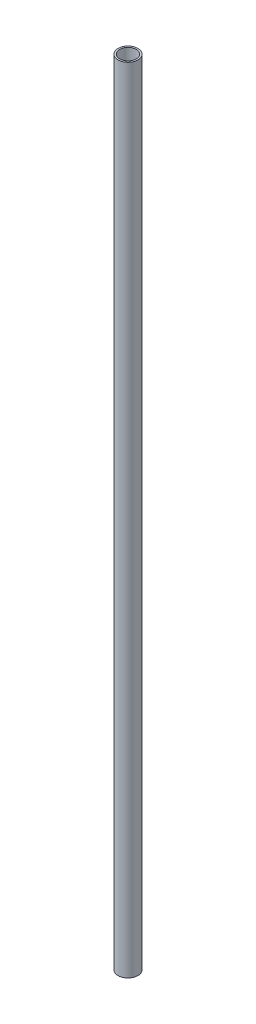
ISO-10303-21;
HEADER;
FILE_DESCRIPTION(('STEP AP214'),'2;1');
FILE_NAME('part.step','',(''),(''),'','','');
FILE_SCHEMA(('AUTOMOTIVE_DESIGN { 1 0 10303 214 1 1 1 1 }'));
ENDSEC;
DATA;
#1=APPLICATION_CONTEXT('core data for automotive mechanical design processes');
#2=APPLICATION_PROTOCOL_DEFINITION('international standard','automotive_design',2000,#1);
#3=PRODUCT_CONTEXT('',#1,'mechanical');
#4=PRODUCT('Part','Part','',(#3));
#5=PRODUCT_RELATED_PRODUCT_CATEGORY('part','',(#4));
#6=PRODUCT_DEFINITION_FORMATION('','',#4);
#7=PRODUCT_DEFINITION_CONTEXT('part definition',#1,'design');
#8=PRODUCT_DEFINITION('design','',#6,#7);
#9=PRODUCT_DEFINITION_SHAPE('','',#8);
#10=(LENGTH_UNIT() NAMED_UNIT(*) SI_UNIT(.MILLI.,.METRE.));
#11=(NAMED_UNIT(*) PLANE_ANGLE_UNIT() SI_UNIT($,.RADIAN.));
#12=(NAMED_UNIT(*) SI_UNIT($,.STERADIAN.) SOLID_ANGLE_UNIT());
#13=UNCERTAINTY_MEASURE_WITH_UNIT(LENGTH_MEASURE(1.E-05),#10,'distance_accuracy_value','');
#14=(GEOMETRIC_REPRESENTATION_CONTEXT(3) GLOBAL_UNCERTAINTY_ASSIGNED_CONTEXT((#13)) GLOBAL_UNIT_ASSIGNED_CONTEXT((#10,
#11,#12)) REPRESENTATION_CONTEXT('',''));
#15=CARTESIAN_POINT('',(0.,0.,0.));
#16=DIRECTION('',(0.,0.,1.));
#17=DIRECTION('',(1.,0.,0.));
#18=AXIS2_PLACEMENT_3D('',#15,#16,#17);
#19=CARTESIAN_POINT('',(682.625,838.202,455.168));
#20=DIRECTION('',(0.,1.,0.));
#21=DIRECTION('',(0.,0.,1.));
#22=AXIS2_PLACEMENT_3D('',#19,#20,#21);
#23=CYLINDRICAL_SURFACE('',#22,17.526);
#24=CARTESIAN_POINT('',(682.625,-838.2,455.168));
#25=DIRECTION('',(0.,1.,0.));
#26=DIRECTION('',(0.,0.,1.));
#27=AXIS2_PLACEMENT_3D('',#24,#25,#26);
#28=CIRCLE('',#27,17.526);
#29=CARTESIAN_POINT('',(682.625,-838.2,472.694));
#30=VERTEX_POINT('',#29);
#31=EDGE_CURVE('E24',#30,#30,#28,.T.);
#32=ORIENTED_EDGE('',*,*,#31,.F.);
#33=EDGE_LOOP('',(#32));
#34=FACE_BOUND('',#33,.T.);
#35=CARTESIAN_POINT('',(682.625,838.2,455.168));
#36=DIRECTION('',(0.,1.,0.));
#37=DIRECTION('',(0.,0.,1.));
#38=AXIS2_PLACEMENT_3D('',#35,#36,#37);
#39=CIRCLE('',#38,17.526);
#40=CARTESIAN_POINT('',(682.625,838.2,472.694));
#41=VERTEX_POINT('',#40);
#42=EDGE_CURVE('E15',#41,#41,#39,.T.);
#43=ORIENTED_EDGE('',*,*,#42,.T.);
#44=EDGE_LOOP('',(#43));
#45=FACE_BOUND('',#44,.T.);
#46=ADVANCED_FACE('F12',(#34,#45),#23,.F.);
#47=CARTESIAN_POINT('',(682.625,838.2,44.45));
#48=DIRECTION('',(0.,-1.,0.));
#49=DIRECTION('',(0.,0.,-1.));
#50=AXIS2_PLACEMENT_3D('',#47,#48,#49);
#51=PLANE('',#50);
#52=ORIENTED_EDGE('',*,*,#42,.F.);
#53=EDGE_LOOP('',(#52));
#54=FACE_BOUND('',#53,.T.);
#55=CARTESIAN_POINT('',(682.625,838.2,455.168));
#56=DIRECTION('',(0.,1.,0.));
#57=DIRECTION('',(0.,0.,1.));
#58=AXIS2_PLACEMENT_3D('',#55,#56,#57);
#59=CIRCLE('',#58,21.082);
#60=CARTESIAN_POINT('',(682.625,838.2,476.25));
#61=VERTEX_POINT('',#60);
#62=EDGE_CURVE('E19',#61,#61,#59,.F.);
#63=ORIENTED_EDGE('',*,*,#62,.F.);
#64=EDGE_LOOP('',(#63));
#65=FACE_BOUND('',#64,.T.);
#66=ADVANCED_FACE('F33',(#54,#65),#51,.F.);
#67=CARTESIAN_POINT('',(682.625,-838.2,260.35));
#68=DIRECTION('',(0.,-1.,0.));
#69=DIRECTION('',(0.,0.,-1.));
#70=AXIS2_PLACEMENT_3D('',#67,#68,#69);
#71=PLANE('',#70);
#72=CARTESIAN_POINT('',(682.625,-838.2,455.168));
#73=DIRECTION('',(0.,1.,0.));
#74=DIRECTION('',(0.,0.,1.));
#75=AXIS2_PLACEMENT_3D('',#72,#73,#74);
#76=CIRCLE('',#75,21.082);
#77=CARTESIAN_POINT('',(682.625,-838.2,476.25));
#78=VERTEX_POINT('',#77);
#79=EDGE_CURVE('E8',#78,#78,#76,.T.);
#80=ORIENTED_EDGE('',*,*,#79,.F.);
#81=EDGE_LOOP('',(#80));
#82=FACE_BOUND('',#81,.T.);
#83=ORIENTED_EDGE('',*,*,#31,.T.);
#84=EDGE_LOOP('',(#83));
#85=FACE_BOUND('',#84,.T.);
#86=ADVANCED_FACE('F36',(#82,#85),#71,.T.);
#87=CARTESIAN_POINT('',(682.625,838.202,455.168));
#88=DIRECTION('',(0.,1.,0.));
#89=DIRECTION('',(0.,0.,1.));
#90=AXIS2_PLACEMENT_3D('',#87,#88,#89);
#91=CYLINDRICAL_SURFACE('',#90,21.082);
#92=ORIENTED_EDGE('',*,*,#79,.T.);
#93=EDGE_LOOP('',(#92));
#94=FACE_BOUND('',#93,.T.);
#95=ORIENTED_EDGE('',*,*,#62,.T.);
#96=EDGE_LOOP('',(#95));
#97=FACE_BOUND('',#96,.T.);
#98=ADVANCED_FACE('F39',(#94,#97),#91,.T.);
#99=CLOSED_SHELL('',(#46,#66,#86,#98));
#100=MANIFOLD_SOLID_BREP('B1',#99);
#101=ADVANCED_BREP_SHAPE_REPRESENTATION('',(#18,#100),#14);
#102=SHAPE_DEFINITION_REPRESENTATION(#9,#101);
ENDSEC;
END-ISO-10303-21;
